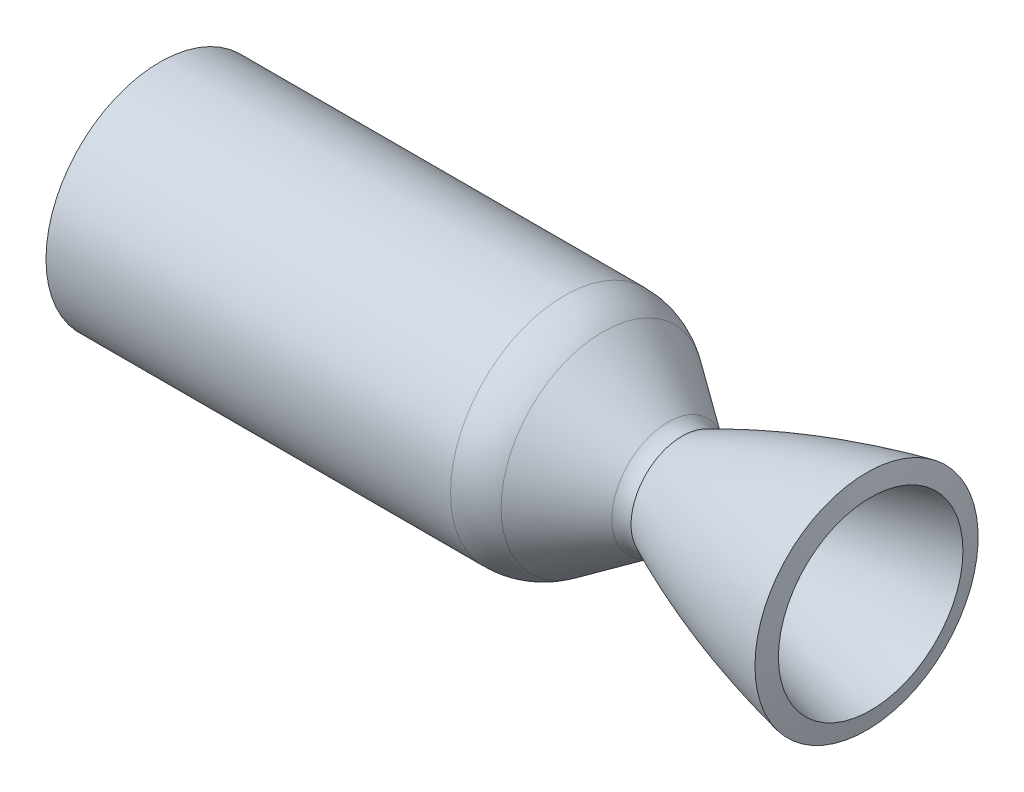
ISO-10303-21;
HEADER;
FILE_DESCRIPTION(('STEP AP214'),'2;1');
FILE_NAME('part.step','',(''),(''),'','','');
FILE_SCHEMA(('AUTOMOTIVE_DESIGN { 1 0 10303 214 1 1 1 1 }'));
ENDSEC;
DATA;
#1=APPLICATION_CONTEXT('core data for automotive mechanical design processes');
#2=APPLICATION_PROTOCOL_DEFINITION('international standard','automotive_design',2000,#1);
#3=PRODUCT_CONTEXT('',#1,'mechanical');
#4=PRODUCT('Part','Part','',(#3));
#5=PRODUCT_RELATED_PRODUCT_CATEGORY('part','',(#4));
#6=PRODUCT_DEFINITION_FORMATION('','',#4);
#7=PRODUCT_DEFINITION_CONTEXT('part definition',#1,'design');
#8=PRODUCT_DEFINITION('design','',#6,#7);
#9=PRODUCT_DEFINITION_SHAPE('','',#8);
#10=(LENGTH_UNIT() NAMED_UNIT(*) SI_UNIT(.MILLI.,.METRE.));
#11=(NAMED_UNIT(*) PLANE_ANGLE_UNIT() SI_UNIT($,.RADIAN.));
#12=(NAMED_UNIT(*) SI_UNIT($,.STERADIAN.) SOLID_ANGLE_UNIT());
#13=UNCERTAINTY_MEASURE_WITH_UNIT(LENGTH_MEASURE(1.E-05),#10,'distance_accuracy_value','');
#14=(GEOMETRIC_REPRESENTATION_CONTEXT(3) GLOBAL_UNCERTAINTY_ASSIGNED_CONTEXT((#13)) GLOBAL_UNIT_ASSIGNED_CONTEXT((#10,
#11,#12)) REPRESENTATION_CONTEXT('',''));
#15=CARTESIAN_POINT('',(0.,0.,0.));
#16=DIRECTION('',(0.,0.,1.));
#17=DIRECTION('',(1.,0.,0.));
#18=AXIS2_PLACEMENT_3D('',#15,#16,#17);
#19=CARTESIAN_POINT('',(-135.910218001968,-8.3385588074193,0.));
#20=DIRECTION('',(-1.,0.,0.));
#21=DIRECTION('',(0.,0.,1.));
#22=AXIS2_PLACEMENT_3D('',#19,#20,#21);
#23=CYLINDRICAL_SURFACE('',#22,29.244200073577);
#24=CARTESIAN_POINT('',(-135.910218001968,-8.3385588074193,0.));
#25=DIRECTION('',(-1.,0.,0.));
#26=DIRECTION('',(0.,0.,1.));
#27=AXIS2_PLACEMENT_3D('',#24,#25,#26);
#28=CIRCLE('',#27,29.244200073577);
#29=CARTESIAN_POINT('',(-135.910218001968,-8.3385588074193,29.244200073577));
#30=VERTEX_POINT('',#29);
#31=EDGE_CURVE('E10',#30,#30,#28,.T.);
#32=ORIENTED_EDGE('',*,*,#31,.F.);
#33=EDGE_LOOP('',(#32));
#34=FACE_BOUND('',#33,.T.);
#35=CARTESIAN_POINT('',(-31.991198041475,-8.3385588074193,0.));
#36=DIRECTION('',(-1.,0.,0.));
#37=DIRECTION('',(0.,0.,1.));
#38=AXIS2_PLACEMENT_3D('',#35,#36,#37);
#39=CIRCLE('',#38,29.244200073577);
#40=CARTESIAN_POINT('',(-31.991198041475,-8.3385588074193,29.244200073577));
#41=VERTEX_POINT('',#40);
#42=EDGE_CURVE('E74',#41,#41,#39,.T.);
#43=ORIENTED_EDGE('',*,*,#42,.T.);
#44=EDGE_LOOP('',(#43));
#45=FACE_BOUND('',#44,.T.);
#46=ADVANCED_FACE('F31',(#34,#45),#23,.T.);
#47=CARTESIAN_POINT('',(-135.910218001968,15.8256412661577,0.));
#48=DIRECTION('',(-1.,0.,0.));
#49=DIRECTION('',(0.,0.,1.));
#50=AXIS2_PLACEMENT_3D('',#47,#48,#49);
#51=PLANE('',#50);
#52=ORIENTED_EDGE('',*,*,#31,.T.);
#53=EDGE_LOOP('',(#52));
#54=FACE_BOUND('',#53,.T.);
#55=CARTESIAN_POINT('',(-135.910218001968,-8.3385588074193,0.));
#56=DIRECTION('',(-1.,0.,0.));
#57=DIRECTION('',(0.,0.,1.));
#58=AXIS2_PLACEMENT_3D('',#55,#56,#57);
#59=CIRCLE('',#58,24.164200073577);
#60=CARTESIAN_POINT('',(-135.910218001968,-8.3385588074193,24.164200073577));
#61=VERTEX_POINT('',#60);
#62=EDGE_CURVE('E37',#61,#61,#59,.T.);
#63=ORIENTED_EDGE('',*,*,#62,.F.);
#64=EDGE_LOOP('',(#63));
#65=FACE_BOUND('',#64,.T.);
#66=ADVANCED_FACE('F121',(#54,#65),#51,.T.);
#67=CARTESIAN_POINT('',(-135.910218001968,-8.3385588074193,0.));
#68=DIRECTION('',(-1.,0.,0.));
#69=DIRECTION('',(0.,0.,1.));
#70=AXIS2_PLACEMENT_3D('',#67,#68,#69);
#71=CYLINDRICAL_SURFACE('',#70,24.164200073577);
#72=ORIENTED_EDGE('',*,*,#62,.T.);
#73=EDGE_LOOP('',(#72));
#74=FACE_BOUND('',#73,.T.);
#75=CARTESIAN_POINT('',(-31.991198041475,-8.3385588074193,0.));
#76=DIRECTION('',(-1.,0.,0.));
#77=DIRECTION('',(0.,0.,1.));
#78=AXIS2_PLACEMENT_3D('',#75,#76,#77);
#79=CIRCLE('',#78,24.164200073577);
#80=CARTESIAN_POINT('',(-31.991198041475,-8.3385588074193,24.164200073577));
#81=VERTEX_POINT('',#80);
#82=EDGE_CURVE('E41',#81,#81,#79,.T.);
#83=ORIENTED_EDGE('',*,*,#82,.F.);
#84=EDGE_LOOP('',(#83));
#85=FACE_BOUND('',#84,.T.);
#86=ADVANCED_FACE('F118',(#74,#85),#71,.F.);
#87=CARTESIAN_POINT('',(-31.9911980414751,-8.3385588074193,0.));
#88=DIRECTION('',(-1.,0.,0.));
#89=DIRECTION('',(0.,0.,1.));
#90=AXIS2_PLACEMENT_3D('',#87,#88,#89);
#91=DEGENERATE_TOROIDAL_SURFACE('',#90,12.006238880023,12.157961193554,.T.);
#92=ORIENTED_EDGE('',*,*,#82,.T.);
#93=EDGE_LOOP('',(#92));
#94=FACE_BOUND('',#93,.T.);
#95=CARTESIAN_POINT('',(-25.017677986782,-8.3385588074193,0.));
#96=DIRECTION('',(-1.,0.,0.));
#97=DIRECTION('',(0.,0.,1.));
#98=AXIS2_PLACEMENT_3D('',#95,#96,#97);
#99=CIRCLE('',#98,21.9654576461089);
#100=CARTESIAN_POINT('',(-25.017677986782,-8.3385588074193,21.9654576461089));
#101=VERTEX_POINT('',#100);
#102=EDGE_CURVE('E45',#101,#101,#99,.T.);
#103=ORIENTED_EDGE('',*,*,#102,.F.);
#104=EDGE_LOOP('',(#103));
#105=FACE_BOUND('',#104,.T.);
#106=ADVANCED_FACE('F114',(#94,#105),#91,.F.);
#107=CARTESIAN_POINT('',(-8.28204231865423,-8.3385588074193,0.));
#108=DIRECTION('',(-1.,0.,0.));
#109=DIRECTION('',(0.,0.,1.));
#110=AXIS2_PLACEMENT_3D('',#107,#108,#109);
#111=CONICAL_SURFACE('',#110,10.247039394555,0.610865238197997);
#112=ORIENTED_EDGE('',*,*,#102,.T.);
#113=EDGE_LOOP('',(#112));
#114=FACE_BOUND('',#113,.T.);
#115=CARTESIAN_POINT('',(-8.28204231865423,-8.3385588074193,0.));
#116=DIRECTION('',(-1.,0.,0.));
#117=DIRECTION('',(0.,0.,1.));
#118=AXIS2_PLACEMENT_3D('',#115,#116,#117);
#119=CIRCLE('',#118,10.247039394555);
#120=CARTESIAN_POINT('',(-8.28204231865423,-8.3385588074193,10.247039394555));
#121=VERTEX_POINT('',#120);
#122=EDGE_CURVE('E50',#121,#121,#119,.T.);
#123=ORIENTED_EDGE('',*,*,#122,.F.);
#124=EDGE_LOOP('',(#123));
#125=FACE_BOUND('',#124,.T.);
#126=ADVANCED_FACE('F110',(#114,#125),#111,.F.);
#127=CARTESIAN_POINT('',(-1.30852226440232,-8.3385588074193,0.));
#128=DIRECTION('',(-1.,0.,0.));
#129=DIRECTION('',(0.,0.,1.));
#130=AXIS2_PLACEMENT_3D('',#127,#128,#129);
#131=TOROIDAL_SURFACE('',#130,20.2062581586451,12.157961191666);
#132=ORIENTED_EDGE('',*,*,#122,.T.);
#133=EDGE_LOOP('',(#132));
#134=FACE_BOUND('',#133,.T.);
#135=CARTESIAN_POINT('',(-1.30852226440231,-8.3385588074193,0.));
#136=DIRECTION('',(-1.,0.,0.));
#137=DIRECTION('',(0.,0.,1.));
#138=AXIS2_PLACEMENT_3D('',#135,#136,#137);
#139=CIRCLE('',#138,8.04829696698084);
#140=CARTESIAN_POINT('',(-1.30852226440231,-8.3385588074193,8.04829696698084));
#141=VERTEX_POINT('',#140);
#142=EDGE_CURVE('E53',#141,#141,#139,.T.);
#143=ORIENTED_EDGE('',*,*,#142,.F.);
#144=EDGE_LOOP('',(#143));
#145=FACE_BOUND('',#144,.T.);
#146=ADVANCED_FACE('F106',(#134,#145),#131,.T.);
#147=CARTESIAN_POINT('',(-1.30852226440232,-8.3385588074193,0.));
#148=DIRECTION('',(-1.,0.,0.));
#149=DIRECTION('',(0.,0.,1.));
#150=AXIS2_PLACEMENT_3D('',#147,#148,#149);
#151=TOROIDAL_SURFACE('',#150,11.1445244185869,3.09622745160607);
#152=ORIENTED_EDGE('',*,*,#142,.T.);
#153=EDGE_LOOP('',(#152));
#154=FACE_BOUND('',#153,.T.);
#155=CARTESIAN_POINT('',(2.20295420794159E-07,-8.3385588074193,0.));
#156=DIRECTION('',(-1.,0.,0.));
#157=DIRECTION('',(0.,0.,1.));
#158=AXIS2_PLACEMENT_3D('',#155,#156,#157);
#159=CIRCLE('',#158,8.33838947188388);
#160=CARTESIAN_POINT('',(2.20295420794159E-07,-8.3385588074193,8.33838947188388));
#161=VERTEX_POINT('',#160);
#162=EDGE_CURVE('E56',#161,#161,#159,.T.);
#163=ORIENTED_EDGE('',*,*,#162,.F.);
#164=EDGE_LOOP('',(#163));
#165=FACE_BOUND('',#164,.T.);
#166=ADVANCED_FACE('F102',(#154,#165),#151,.T.);
#167=CARTESIAN_POINT('',(46.7052662316051,15.3633427918392,0.));
#168=CARTESIAN_POINT('',(46.524750515161,15.3249694590692,0.));
#169=CARTESIAN_POINT('',(46.1547235495677,15.2457816608781,0.));
#170=CARTESIAN_POINT('',(45.3412752334271,15.0704774801376,0.));
#171=CARTESIAN_POINT('',(44.5761839537256,14.9014581025662,0.));
#172=CARTESIAN_POINT('',(43.4515538362962,14.6503920491247,0.));
#173=CARTESIAN_POINT('',(42.1906543060176,14.3614883846365,0.));
#174=CARTESIAN_POINT('',(40.88006858139,14.0538662193581,0.));
#175=CARTESIAN_POINT('',(39.6027660942069,13.7450760274619,0.));
#176=CARTESIAN_POINT('',(38.3116061804075,13.426689796631,0.));
#177=CARTESIAN_POINT('',(36.6010906111545,12.9956106623935,0.));
#178=CARTESIAN_POINT('',(34.6758321598759,12.4927586672972,0.));
#179=CARTESIAN_POINT('',(32.5461042976974,11.9132423649056,0.));
#180=CARTESIAN_POINT('',(30.4204145175512,11.3114144115481,0.));
#181=CARTESIAN_POINT('',(28.7246351658482,10.8169490825635,0.));
#182=CARTESIAN_POINT('',(26.6562057830378,10.1961547040312,0.));
#183=CARTESIAN_POINT('',(24.5948325284391,9.55424990703913,0.));
#184=CARTESIAN_POINT('',(22.5397255166355,8.89062427856379,0.));
#185=CARTESIAN_POINT('',(20.4923633349877,8.20548452456071,0.));
#186=CARTESIAN_POINT('',(18.8211625895476,7.63076168096987,0.));
#187=CARTESIAN_POINT('',(17.1559281391293,7.04263341834743,0.));
#188=CARTESIAN_POINT('',(15.4938455352911,6.4396368139182,0.));
#189=CARTESIAN_POINT('',(13.8400209421102,5.82397887254964,0.));
#190=CARTESIAN_POINT('',(12.1864689362427,5.19177951139044,0.));
#191=CARTESIAN_POINT('',(10.5467973394122,4.54922092512744,0.));
#192=CARTESIAN_POINT('',(8.89903325935378,3.88590146700636,0.));
#193=CARTESIAN_POINT('',(7.27993675213459,3.21880754139961,0.));
#194=CARTESIAN_POINT('',(5.62879119841598,2.51947475387613,0.));
#195=CARTESIAN_POINT('',(4.04943657601686,1.83617790016319,0.));
#196=CARTESIAN_POINT('',(2.56587533635837,1.17551415604462,0.));
#197=CARTESIAN_POINT('',(1.47508431169381,0.68247871333233,0.));
#198=CARTESIAN_POINT('',(0.508244333847498,0.236091737981903,0.));
#199=CARTESIAN_POINT('',(0.167257497499216,0.0778273165920539,0.));
#200=CARTESIAN_POINT('',(2.20295433574192E-07,-0.000169335535423371,0.));
#201=B_SPLINE_CURVE_WITH_KNOTS('',4,(#167,#168,#169,#170,#171,#172,#173,#174,#175,#176,#177,
#178,#179,#180,#181,#182,#183,#184,#185,#186,#187,#188,#189,#190,#191,#192,#193,#194,#195,#196,
#197,#198,#199,#200),.UNSPECIFIED.,.F.,.F.,(5,1,1,1,1,1,1,1,1,1,1,1,1,1,1,1,1,1,1,1,1,1,1,1,1,1,
1,1,1,1,5),(0.0835401844002588,0.0985219213311126,0.113503660665257,0.128485399999402,
0.143467139333546,0.173430617582836,0.203394095832125,0.218375835266359,0.233357574700593,
0.263321053569061,0.323248010429973,0.353211489465126,0.38317496850028,0.413138450385237,
0.443101932270194,0.499688998752863,0.52965247958911,0.559615960902706,0.589579445255073,
0.619542925209227,0.649506397327245,0.679469878885802,0.709433352822979,0.739396825399046,
0.769360302211025,0.799323783577173,0.829287266638208,0.859250757718747,0.889214229009439,
0.904195976694662,0.919177724463163),.UNSPECIFIED.);
#202=CARTESIAN_POINT('',(-135.910218001968,-8.3385588074193,0.));
#203=DIRECTION('',(-1.,0.,0.));
#204=AXIS1_PLACEMENT('',#202,#203);
#205=SURFACE_OF_REVOLUTION('',#201,#204);
#206=ORIENTED_EDGE('',*,*,#162,.T.);
#207=EDGE_LOOP('',(#206));
#208=FACE_BOUND('',#207,.T.);
#209=CARTESIAN_POINT('',(46.705266231605,-8.3385588074193,0.));
#210=DIRECTION('',(-1.,0.,0.));
#211=DIRECTION('',(0.,0.,1.));
#212=AXIS2_PLACEMENT_3D('',#209,#210,#211);
#213=CIRCLE('',#212,23.7019015992585);
#214=CARTESIAN_POINT('',(46.705266231605,-8.3385588074193,23.7019015992585));
#215=VERTEX_POINT('',#214);
#216=EDGE_CURVE('E59',#215,#215,#213,.T.);
#217=ORIENTED_EDGE('',*,*,#216,.F.);
#218=EDGE_LOOP('',(#217));
#219=FACE_BOUND('',#218,.T.);
#220=ADVANCED_FACE('F98',(#208,#219),#205,.F.);
#221=CARTESIAN_POINT('',(45.6489818015794,-8.3385588074193,0.));
#222=DIRECTION('',(-1.,0.,0.));
#223=DIRECTION('',(0.,0.,1.));
#224=AXIS2_PLACEMENT_3D('',#221,#222,#223);
#225=CONICAL_SURFACE('',#224,28.6708716336706,1.36133809225545);
#226=ORIENTED_EDGE('',*,*,#216,.T.);
#227=EDGE_LOOP('',(#226));
#228=FACE_BOUND('',#227,.T.);
#229=CARTESIAN_POINT('',(45.6489818015794,-8.3385588074193,0.));
#230=DIRECTION('',(-1.,0.,0.));
#231=DIRECTION('',(0.,0.,1.));
#232=AXIS2_PLACEMENT_3D('',#229,#230,#231);
#233=CIRCLE('',#232,28.6708716336706);
#234=CARTESIAN_POINT('',(45.6489818015794,-8.3385588074193,28.6708716336706));
#235=VERTEX_POINT('',#234);
#236=EDGE_CURVE('E62',#235,#235,#233,.T.);
#237=ORIENTED_EDGE('',*,*,#236,.F.);
#238=EDGE_LOOP('',(#237));
#239=FACE_BOUND('',#238,.T.);
#240=ADVANCED_FACE('F93',(#228,#239),#225,.T.);
#241=CARTESIAN_POINT('',(45.6489818015794,20.3323128262513,0.));
#242=CARTESIAN_POINT('',(45.5421877097517,20.3096109512883,0.));
#243=CARTESIAN_POINT('',(45.4330960137334,20.2863193321394,0.));
#244=CARTESIAN_POINT('',(45.1963032641701,20.2355812530993,0.));
#245=CARTESIAN_POINT('',(45.0685251749477,20.2081186334002,0.));
#246=CARTESIAN_POINT('',(44.7989053643195,20.1500037841153,0.));
#247=CARTESIAN_POINT('',(44.657852254533,20.1195187849401,0.));
#248=CARTESIAN_POINT('',(44.381398864351,20.0595442324424,0.));
#249=CARTESIAN_POINT('',(44.2461514651114,20.0300869333035,0.));
#250=CARTESIAN_POINT('',(43.8572450013224,19.9449809678073,0.));
#251=CARTESIAN_POINT('',(43.6202183846848,19.892563633543,0.));
#252=CARTESIAN_POINT('',(43.1269574751236,19.7828715448304,0.));
#253=CARTESIAN_POINT('',(42.8699250525711,19.7254138095018,0.));
#254=CARTESIAN_POINT('',(42.0991066020727,19.551823965349,0.));
#255=CARTESIAN_POINT('',(41.5986470659701,19.4372898377381,0.));
#256=CARTESIAN_POINT('',(40.5933213967377,19.2040409673001,0.));
#257=CARTESIAN_POINT('',(40.085561703738,19.0846859442147,0.));
#258=CARTESIAN_POINT('',(39.0742976900497,18.8434939621264,0.));
#259=CARTESIAN_POINT('',(38.5726084667379,18.722063376464,0.));
#260=CARTESIAN_POINT('',(37.5661694073435,18.475233129632,0.));
#261=CARTESIAN_POINT('',(37.0608496283578,18.349658799426,0.));
#262=CARTESIAN_POINT('',(35.551769376294,17.9693114734967,0.));
#263=CARTESIAN_POINT('',(34.5477005382309,17.7093847346992,0.));
#264=CARTESIAN_POINT('',(29.5309428036298,16.3757399058116,0.));
#265=CARTESIAN_POINT('',(25.5438939958685,15.203404800808,0.));
#266=CARTESIAN_POINT('',(19.6112892093464,13.2765134495632,0.));
#267=CARTESIAN_POINT('',(17.6424658449245,12.6064059037799,0.));
#268=CARTESIAN_POINT('',(14.7020747591625,11.5577070887864,0.));
#269=CARTESIAN_POINT('',(13.7248544586288,11.2011655909545,0.));
#270=CARTESIAN_POINT('',(11.7747091736064,10.473387080905,0.));
#271=CARTESIAN_POINT('',(10.8011642488118,10.1017375053968,0.));
#272=CARTESIAN_POINT('',(8.86331271144115,9.3456734013827,0.));
#273=CARTESIAN_POINT('',(7.89185790138045,8.95794903945217,0.));
#274=CARTESIAN_POINT('',(6.44864190732097,8.36967092822139,0.));
#275=CARTESIAN_POINT('',(5.96896163050901,8.17209903956657,0.));
#276=CARTESIAN_POINT('',(5.00485746998899,7.77036349189925,0.));
#277=CARTESIAN_POINT('',(4.52084413018263,7.56634929163411,0.));
#278=CARTESIAN_POINT('',(3.56368809170438,7.15890766927419,0.));
#279=CARTESIAN_POINT('',(3.09163622249494,6.95603975797138,0.));
#280=CARTESIAN_POINT('',(2.13701927889862,6.54104487174335,0.));
#281=CARTESIAN_POINT('',(1.64982161259449,6.32669624254279,0.));
#282=CARTESIAN_POINT('',(0.930983662575363,6.00730229508728,0.));
#283=CARTESIAN_POINT('',(0.695217937858623,5.90206323533322,0.));
#284=CARTESIAN_POINT('',(0.230480195303941,5.69365786283899,0.));
#285=CARTESIAN_POINT('',(0.00145519882677418,5.59046649210819,0.));
#286=CARTESIAN_POINT('',(-0.468768541290507,5.37728700841597,0.));
#287=CARTESIAN_POINT('',(-0.713899867185436,5.26546160346012,0.));
#288=CARTESIAN_POINT('',(-1.22787570834377,5.0295809800574,0.));
#289=CARTESIAN_POINT('',(-1.49236046498114,4.90756544737323,0.));
#290=CARTESIAN_POINT('',(-1.7208877601839,4.80176067836575,0.));
#291=B_SPLINE_CURVE_WITH_KNOTS('',3,(#241,#242,#243,#244,#245,#246,#247,#248,#249,#250,#251,
#252,#253,#254,#255,#256,#257,#258,#259,#260,#261,#262,#263,#264,#265,#266,#267,#268,#269,#270,
#271,#272,#273,#274,#275,#276,#277,#278,#279,#280,#281,#282,#283,#284,#285,#286,#287,#288,#289,
#290),.UNSPECIFIED.,.F.,.F.,(4,2,2,2,2,2,2,2,2,2,2,2,2,2,2,2,2,2,2,2,2,2,2,2,4),(0.,
0.00781249999999985,0.0156249999999997,0.0234374999999995,0.0312499999999994,0.0468749999999994,
0.0624999999999995,0.0937499999999995,0.125,0.15625,0.1875,0.25,0.5,0.625,0.6875,0.75,0.8125,
0.84375,0.875,0.90625,0.9375,0.953125,0.96875,0.984375,1.),.UNSPECIFIED.);
#292=CARTESIAN_POINT('',(-135.910218001968,-8.3385588074193,0.));
#293=DIRECTION('',(-1.,0.,0.));
#294=AXIS1_PLACEMENT('',#292,#293);
#295=SURFACE_OF_REVOLUTION('',#291,#294);
#296=CARTESIAN_POINT('',(-1.72088776018392,-8.3385588074193,0.));
#297=DIRECTION('',(-1.,0.,0.));
#298=DIRECTION('',(0.,0.,1.));
#299=AXIS2_PLACEMENT_3D('',#296,#297,#298);
#300=CIRCLE('',#299,13.1403194857851);
#301=CARTESIAN_POINT('',(-1.72088776018392,-8.3385588074193,13.1403194857851));
#302=VERTEX_POINT('',#301);
#303=EDGE_CURVE('E65',#302,#302,#300,.T.);
#304=ORIENTED_EDGE('',*,*,#303,.F.);
#305=EDGE_LOOP('',(#304));
#306=FACE_BOUND('',#305,.T.);
#307=ORIENTED_EDGE('',*,*,#236,.T.);
#308=EDGE_LOOP('',(#307));
#309=FACE_BOUND('',#308,.T.);
#310=ADVANCED_FACE('F88',(#306,#309),#295,.T.);
#311=CARTESIAN_POINT('',(-1.30852226440232,-8.3385588074193,0.));
#312=DIRECTION('',(-1.,0.,0.));
#313=DIRECTION('',(0.,0.,1.));
#314=AXIS2_PLACEMENT_3D('',#311,#312,#313);
#315=TOROIDAL_SURFACE('',#314,20.2062581586451,7.07796119166601);
#316=CARTESIAN_POINT('',(-5.36827402199097,-8.3385588074193,0.));
#317=DIRECTION('',(-1.,0.,0.));
#318=DIRECTION('',(0.,0.,1.));
#319=AXIS2_PLACEMENT_3D('',#316,#317,#318);
#320=CIRCLE('',#319,14.4083317795432);
#321=CARTESIAN_POINT('',(-5.36827402199097,-8.3385588074193,14.4083317795432));
#322=VERTEX_POINT('',#321);
#323=EDGE_CURVE('E68',#322,#322,#320,.T.);
#324=ORIENTED_EDGE('',*,*,#323,.F.);
#325=EDGE_LOOP('',(#324));
#326=FACE_BOUND('',#325,.T.);
#327=ORIENTED_EDGE('',*,*,#303,.T.);
#328=EDGE_LOOP('',(#327));
#329=FACE_BOUND('',#328,.T.);
#330=ADVANCED_FACE('F92',(#326,#329),#315,.F.);
#331=CARTESIAN_POINT('',(-5.36827402199097,-8.3385588074193,0.));
#332=DIRECTION('',(-1.,0.,0.));
#333=DIRECTION('',(0.,0.,1.));
#334=AXIS2_PLACEMENT_3D('',#331,#332,#333);
#335=CONICAL_SURFACE('',#334,14.4083317795432,0.610865238197996);
#336=CARTESIAN_POINT('',(-22.1039096901187,-8.3385588074193,0.));
#337=DIRECTION('',(-1.,0.,0.));
#338=DIRECTION('',(0.,0.,1.));
#339=AXIS2_PLACEMENT_3D('',#336,#337,#338);
#340=CIRCLE('',#339,26.126750031097);
#341=CARTESIAN_POINT('',(-22.1039096901187,-8.3385588074193,26.126750031097));
#342=VERTEX_POINT('',#341);
#343=EDGE_CURVE('E71',#342,#342,#340,.T.);
#344=ORIENTED_EDGE('',*,*,#343,.F.);
#345=EDGE_LOOP('',(#344));
#346=FACE_BOUND('',#345,.T.);
#347=ORIENTED_EDGE('',*,*,#323,.T.);
#348=EDGE_LOOP('',(#347));
#349=FACE_BOUND('',#348,.T.);
#350=ADVANCED_FACE('F136',(#346,#349),#335,.T.);
#351=CARTESIAN_POINT('',(-31.9911980414751,-8.3385588074193,0.));
#352=DIRECTION('',(-1.,0.,0.));
#353=DIRECTION('',(0.,0.,1.));
#354=AXIS2_PLACEMENT_3D('',#351,#352,#353);
#355=DEGENERATE_TOROIDAL_SURFACE('',#354,12.006238880023,17.237961193554,.T.);
#356=ORIENTED_EDGE('',*,*,#42,.F.);
#357=EDGE_LOOP('',(#356));
#358=FACE_BOUND('',#357,.T.);
#359=ORIENTED_EDGE('',*,*,#343,.T.);
#360=EDGE_LOOP('',(#359));
#361=FACE_BOUND('',#360,.T.);
#362=ADVANCED_FACE('F133',(#358,#361),#355,.T.);
#363=CLOSED_SHELL('',(#46,#66,#86,#106,#126,#146,#166,#220,#240,#310,#330,#350,#362));
#364=MANIFOLD_SOLID_BREP('B2',#363);
#365=ADVANCED_BREP_SHAPE_REPRESENTATION('',(#18,#364),#14);
#366=SHAPE_DEFINITION_REPRESENTATION(#9,#365);
ENDSEC;
END-ISO-10303-21;
